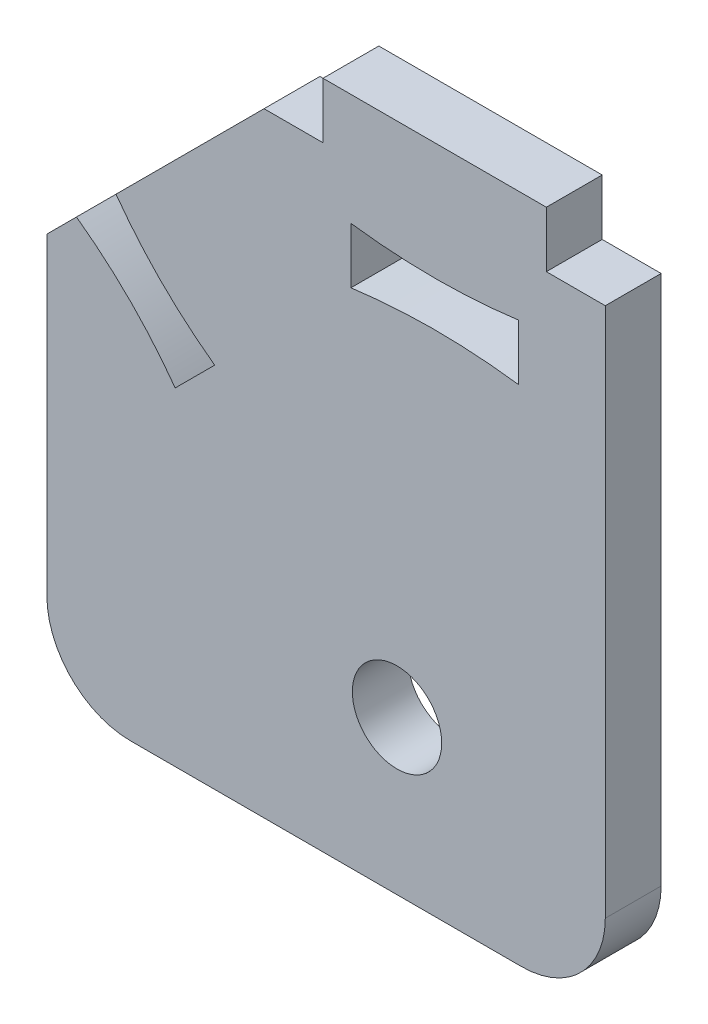
ISO-10303-21;
HEADER;
FILE_DESCRIPTION(('STEP AP214'),'2;1');
FILE_NAME('part.step','',(''),(''),'','','');
FILE_SCHEMA(('AUTOMOTIVE_DESIGN { 1 0 10303 214 1 1 1 1 }'));
ENDSEC;
DATA;
#1=APPLICATION_CONTEXT('core data for automotive mechanical design processes');
#2=APPLICATION_PROTOCOL_DEFINITION('international standard','automotive_design',2000,#1);
#3=PRODUCT_CONTEXT('',#1,'mechanical');
#4=PRODUCT('Part','Part','',(#3));
#5=PRODUCT_RELATED_PRODUCT_CATEGORY('part','',(#4));
#6=PRODUCT_DEFINITION_FORMATION('','',#4);
#7=PRODUCT_DEFINITION_CONTEXT('part definition',#1,'design');
#8=PRODUCT_DEFINITION('design','',#6,#7);
#9=PRODUCT_DEFINITION_SHAPE('','',#8);
#10=(LENGTH_UNIT() NAMED_UNIT(*) SI_UNIT(.MILLI.,.METRE.));
#11=(NAMED_UNIT(*) PLANE_ANGLE_UNIT() SI_UNIT($,.RADIAN.));
#12=(NAMED_UNIT(*) SI_UNIT($,.STERADIAN.) SOLID_ANGLE_UNIT());
#13=UNCERTAINTY_MEASURE_WITH_UNIT(LENGTH_MEASURE(1.E-05),#10,'distance_accuracy_value','');
#14=(GEOMETRIC_REPRESENTATION_CONTEXT(3) GLOBAL_UNCERTAINTY_ASSIGNED_CONTEXT((#13)) GLOBAL_UNIT_ASSIGNED_CONTEXT((#10,
#11,#12)) REPRESENTATION_CONTEXT('',''));
#15=CARTESIAN_POINT('',(0.,0.,0.));
#16=DIRECTION('',(0.,0.,1.));
#17=DIRECTION('',(1.,0.,0.));
#18=AXIS2_PLACEMENT_3D('',#15,#16,#17);
#19=CARTESIAN_POINT('',(4.10121933088198,14.7875108318972,2.));
#20=DIRECTION('',(0.,0.,-1.));
#21=DIRECTION('',(-1.,0.,0.));
#22=AXIS2_PLACEMENT_3D('',#19,#20,#21);
#23=PLANE('',#22);
#24=CARTESIAN_POINT('',(10.889087296526,18.,2.));
#25=CARTESIAN_POINT('',(13.889087296526,18.4,2.));
#26=CARTESIAN_POINT('',(16.889087296526,18.,2.));
#27=B_SPLINE_CURVE_WITH_KNOTS('',2,(#24,#25,#26),.UNSPECIFIED.,.F.,.F.,(3,3),(0.,1.),.UNSPECIFIED.);
#28=CARTESIAN_POINT('',(10.889087296526,18.,2.));
#29=VERTEX_POINT('',#28);
#30=CARTESIAN_POINT('',(16.889087296526,18.,2.));
#31=VERTEX_POINT('',#30);
#32=EDGE_CURVE('E166',#29,#31,#27,.T.);
#33=ORIENTED_EDGE('',*,*,#32,.F.);
#34=DIRECTION('',(0.,-1.,0.));
#35=VECTOR('',#34,1.);
#36=CARTESIAN_POINT('',(10.889087296526,20.,2.));
#37=LINE('',#36,#35);
#38=CARTESIAN_POINT('',(10.889087296526,20.,2.));
#39=VERTEX_POINT('',#38);
#40=EDGE_CURVE('E192',#39,#29,#37,.T.);
#41=ORIENTED_EDGE('',*,*,#40,.F.);
#42=CARTESIAN_POINT('',(16.889087296526,20.,2.));
#43=CARTESIAN_POINT('',(13.889087296526,19.6,2.));
#44=CARTESIAN_POINT('',(10.889087296526,20.,2.));
#45=B_SPLINE_CURVE_WITH_KNOTS('',2,(#42,#43,#44),.UNSPECIFIED.,.F.,.F.,(3,3),(0.,1.),.UNSPECIFIED.);
#46=CARTESIAN_POINT('',(16.889087296526,20.,2.));
#47=VERTEX_POINT('',#46);
#48=EDGE_CURVE('E190',#47,#39,#45,.T.);
#49=ORIENTED_EDGE('',*,*,#48,.F.);
#50=DIRECTION('',(0.,1.,0.));
#51=VECTOR('',#50,1.);
#52=CARTESIAN_POINT('',(16.889087296526,20.,2.));
#53=LINE('',#52,#51);
#54=EDGE_CURVE('E176',#31,#47,#53,.T.);
#55=ORIENTED_EDGE('',*,*,#54,.F.);
#56=EDGE_LOOP('',(#33,#41,#49,#55));
#57=FACE_BOUND('',#56,.T.);
#58=DIRECTION('',(1.,0.,0.));
#59=VECTOR('',#58,1.);
#60=CARTESIAN_POINT('',(0.,0.,2.));
#61=LINE('',#60,#59);
#62=CARTESIAN_POINT('',(3.,0.,2.));
#63=VERTEX_POINT('',#62);
#64=CARTESIAN_POINT('',(17.,0.,2.));
#65=VERTEX_POINT('',#64);
#66=EDGE_CURVE('E290',#63,#65,#61,.T.);
#67=ORIENTED_EDGE('',*,*,#66,.T.);
#68=CARTESIAN_POINT('',(17.,3.,2.));
#69=DIRECTION('',(0.,0.,-1.));
#70=DIRECTION('',(-1.,0.,0.));
#71=AXIS2_PLACEMENT_3D('',#68,#69,#70);
#72=CIRCLE('',#71,3.);
#73=CARTESIAN_POINT('',(20.,3.,2.));
#74=VERTEX_POINT('',#73);
#75=EDGE_CURVE('E40',#65,#74,#72,.F.);
#76=ORIENTED_EDGE('',*,*,#75,.T.);
#77=DIRECTION('',(0.,1.,0.));
#78=VECTOR('',#77,1.);
#79=CARTESIAN_POINT('',(20.,0.,2.));
#80=LINE('',#79,#78);
#81=CARTESIAN_POINT('',(20.,22.,2.));
#82=VERTEX_POINT('',#81);
#83=EDGE_CURVE('E338',#74,#82,#80,.T.);
#84=ORIENTED_EDGE('',*,*,#83,.T.);
#85=DIRECTION('',(-1.,0.,0.));
#86=VECTOR('',#85,1.);
#87=CARTESIAN_POINT('',(20.,22.,2.));
#88=LINE('',#87,#86);
#89=CARTESIAN_POINT('',(17.889087296526,22.,2.));
#90=VERTEX_POINT('',#89);
#91=EDGE_CURVE('E346',#82,#90,#88,.T.);
#92=ORIENTED_EDGE('',*,*,#91,.T.);
#93=DIRECTION('',(0.,1.,0.));
#94=VECTOR('',#93,1.);
#95=CARTESIAN_POINT('',(17.889087296526,24.,2.));
#96=LINE('',#95,#94);
#97=CARTESIAN_POINT('',(17.889087296526,24.,2.));
#98=VERTEX_POINT('',#97);
#99=EDGE_CURVE('E402',#90,#98,#96,.T.);
#100=ORIENTED_EDGE('',*,*,#99,.T.);
#101=DIRECTION('',(-1.,0.,0.));
#102=VECTOR('',#101,1.);
#103=CARTESIAN_POINT('',(9.88908729652604,24.,2.));
#104=LINE('',#103,#102);
#105=CARTESIAN_POINT('',(9.88908729652604,24.,2.));
#106=VERTEX_POINT('',#105);
#107=EDGE_CURVE('E398',#98,#106,#104,.T.);
#108=ORIENTED_EDGE('',*,*,#107,.T.);
#109=DIRECTION('',(0.,-1.,0.));
#110=VECTOR('',#109,1.);
#111=CARTESIAN_POINT('',(9.88908729652604,22.,2.));
#112=LINE('',#111,#110);
#113=CARTESIAN_POINT('',(9.88908729652604,22.,2.));
#114=VERTEX_POINT('',#113);
#115=EDGE_CURVE('E390',#106,#114,#112,.T.);
#116=ORIENTED_EDGE('',*,*,#115,.T.);
#117=DIRECTION('',(-1.,0.,0.));
#118=VECTOR('',#117,1.);
#119=CARTESIAN_POINT('',(9.88908729652604,22.,2.));
#120=LINE('',#119,#118);
#121=CARTESIAN_POINT('',(7.77817459305208,22.,2.));
#122=VERTEX_POINT('',#121);
#123=EDGE_CURVE('E385',#114,#122,#120,.T.);
#124=ORIENTED_EDGE('',*,*,#123,.T.);
#125=DIRECTION('',(-0.707106781186553,-0.707106781186542,0.));
#126=VECTOR('',#125,1.);
#127=CARTESIAN_POINT('',(2.47487373415294,16.6966991411009,2.));
#128=LINE('',#127,#126);
#129=CARTESIAN_POINT('',(2.47487373415294,16.6966991411009,2.));
#130=VERTEX_POINT('',#129);
#131=EDGE_CURVE('E381',#122,#130,#128,.T.);
#132=ORIENTED_EDGE('',*,*,#131,.T.);
#133=CARTESIAN_POINT('',(2.47487373415294,16.6966991411009,2.));
#134=CARTESIAN_POINT('',(3.95979797464467,14.6460894756599,2.));
#135=CARTESIAN_POINT('',(6.01040764008564,13.1611652351682,2.));
#136=B_SPLINE_CURVE_WITH_KNOTS('',2,(#133,#134,#135),.UNSPECIFIED.,.F.,.F.,(3,3),(0.,1.),.UNSPECIFIED.);
#137=CARTESIAN_POINT('',(6.01040764008565,13.1611652351682,2.));
#138=VERTEX_POINT('',#137);
#139=EDGE_CURVE('E372',#130,#138,#136,.T.);
#140=ORIENTED_EDGE('',*,*,#139,.T.);
#141=DIRECTION('',(-0.707106781186553,-0.707106781186542,0.));
#142=VECTOR('',#141,1.);
#143=CARTESIAN_POINT('',(4.59619407771254,11.7469516727951,2.));
#144=LINE('',#143,#142);
#145=CARTESIAN_POINT('',(4.59619407771254,11.7469516727951,2.));
#146=VERTEX_POINT('',#145);
#147=EDGE_CURVE('E246',#138,#146,#144,.T.);
#148=ORIENTED_EDGE('',*,*,#147,.T.);
#149=CARTESIAN_POINT('',(4.59619407771254,11.7469516727951,2.));
#150=CARTESIAN_POINT('',(3.1112698372208,13.7975613382361,2.));
#151=CARTESIAN_POINT('',(1.06066017177983,15.2824855787278,2.));
#152=B_SPLINE_CURVE_WITH_KNOTS('',2,(#149,#150,#151),.UNSPECIFIED.,.F.,.F.,(3,3),(0.,1.),.UNSPECIFIED.);
#153=CARTESIAN_POINT('',(1.06066017177983,15.2824855787278,2.));
#154=VERTEX_POINT('',#153);
#155=EDGE_CURVE('E239',#146,#154,#152,.T.);
#156=ORIENTED_EDGE('',*,*,#155,.T.);
#157=DIRECTION('',(-0.707106781186554,-0.707106781186541,0.));
#158=VECTOR('',#157,1.);
#159=CARTESIAN_POINT('',(0.,14.221825406948,2.));
#160=LINE('',#159,#158);
#161=CARTESIAN_POINT('',(0.,14.221825406948,2.));
#162=VERTEX_POINT('',#161);
#163=EDGE_CURVE('E245',#154,#162,#160,.T.);
#164=ORIENTED_EDGE('',*,*,#163,.T.);
#165=DIRECTION('',(0.,-1.,0.));
#166=VECTOR('',#165,1.);
#167=CARTESIAN_POINT('',(0.,0.,2.));
#168=LINE('',#167,#166);
#169=CARTESIAN_POINT('',(0.,3.,2.));
#170=VERTEX_POINT('',#169);
#171=EDGE_CURVE('E252',#162,#170,#168,.T.);
#172=ORIENTED_EDGE('',*,*,#171,.T.);
#173=CARTESIAN_POINT('',(3.,3.,2.));
#174=DIRECTION('',(0.,0.,-1.));
#175=DIRECTION('',(-1.,0.,0.));
#176=AXIS2_PLACEMENT_3D('',#173,#174,#175);
#177=CIRCLE('',#176,3.);
#178=EDGE_CURVE('E334',#170,#63,#177,.F.);
#179=ORIENTED_EDGE('',*,*,#178,.T.);
#180=EDGE_LOOP('',(#67,#76,#84,#92,#100,#108,#116,#124,#132,#140,#148,#156,#164,#172,#179));
#181=FACE_BOUND('',#180,.T.);
#182=CARTESIAN_POINT('',(12.5402020253552,5.5,2.));
#183=DIRECTION('',(0.,0.,1.));
#184=DIRECTION('',(1.,0.,0.));
#185=AXIS2_PLACEMENT_3D('',#182,#183,#184);
#186=CIRCLE('',#185,1.6);
#187=CARTESIAN_POINT('',(14.1402020253552,5.5,2.));
#188=VERTEX_POINT('',#187);
#189=EDGE_CURVE('E450',#188,#188,#186,.T.);
#190=ORIENTED_EDGE('',*,*,#189,.F.);
#191=EDGE_LOOP('',(#190));
#192=FACE_BOUND('',#191,.T.);
#193=ADVANCED_FACE('F32',(#57,#181,#192),#23,.F.);
#194=CARTESIAN_POINT('',(4.10121933088198,14.7875108318972,0.));
#195=DIRECTION('',(0.,0.,-1.));
#196=DIRECTION('',(-1.,0.,0.));
#197=AXIS2_PLACEMENT_3D('',#194,#195,#196);
#198=PLANE('',#197);
#199=DIRECTION('',(0.,-1.,0.));
#200=VECTOR('',#199,1.);
#201=CARTESIAN_POINT('',(10.889087296526,20.,0.));
#202=LINE('',#201,#200);
#203=CARTESIAN_POINT('',(10.889087296526,20.,0.));
#204=VERTEX_POINT('',#203);
#205=CARTESIAN_POINT('',(10.889087296526,18.,0.));
#206=VERTEX_POINT('',#205);
#207=EDGE_CURVE('E177',#204,#206,#202,.T.);
#208=ORIENTED_EDGE('',*,*,#207,.T.);
#209=CARTESIAN_POINT('',(10.889087296526,18.,0.));
#210=CARTESIAN_POINT('',(13.889087296526,18.4,0.));
#211=CARTESIAN_POINT('',(16.889087296526,18.,0.));
#212=B_SPLINE_CURVE_WITH_KNOTS('',2,(#209,#210,#211),.UNSPECIFIED.,.F.,.F.,(3,3),(0.,1.),.UNSPECIFIED.);
#213=CARTESIAN_POINT('',(16.889087296526,18.,0.));
#214=VERTEX_POINT('',#213);
#215=EDGE_CURVE('E454',#206,#214,#212,.T.);
#216=ORIENTED_EDGE('',*,*,#215,.T.);
#217=DIRECTION('',(0.,1.,0.));
#218=VECTOR('',#217,1.);
#219=CARTESIAN_POINT('',(16.889087296526,20.,0.));
#220=LINE('',#219,#218);
#221=CARTESIAN_POINT('',(16.889087296526,20.,0.));
#222=VERTEX_POINT('',#221);
#223=EDGE_CURVE('E183',#214,#222,#220,.T.);
#224=ORIENTED_EDGE('',*,*,#223,.T.);
#225=CARTESIAN_POINT('',(16.889087296526,20.,0.));
#226=CARTESIAN_POINT('',(13.889087296526,19.6,0.));
#227=CARTESIAN_POINT('',(10.889087296526,20.,0.));
#228=B_SPLINE_CURVE_WITH_KNOTS('',2,(#225,#226,#227),.UNSPECIFIED.,.F.,.F.,(3,3),(0.,1.),.UNSPECIFIED.);
#229=EDGE_CURVE('E457',#222,#204,#228,.T.);
#230=ORIENTED_EDGE('',*,*,#229,.T.);
#231=EDGE_LOOP('',(#208,#216,#224,#230));
#232=FACE_BOUND('',#231,.T.);
#233=DIRECTION('',(0.,1.,0.));
#234=VECTOR('',#233,1.);
#235=CARTESIAN_POINT('',(20.,0.,0.));
#236=LINE('',#235,#234);
#237=CARTESIAN_POINT('',(20.,3.,0.));
#238=VERTEX_POINT('',#237);
#239=CARTESIAN_POINT('',(20.,22.,0.));
#240=VERTEX_POINT('',#239);
#241=EDGE_CURVE('E256',#238,#240,#236,.T.);
#242=ORIENTED_EDGE('',*,*,#241,.F.);
#243=CARTESIAN_POINT('',(17.,3.,0.));
#244=DIRECTION('',(0.,0.,-1.));
#245=DIRECTION('',(-1.,0.,0.));
#246=AXIS2_PLACEMENT_3D('',#243,#244,#245);
#247=CIRCLE('',#246,3.);
#248=CARTESIAN_POINT('',(17.,0.,0.));
#249=VERTEX_POINT('',#248);
#250=EDGE_CURVE('E328',#238,#249,#247,.T.);
#251=ORIENTED_EDGE('',*,*,#250,.T.);
#252=DIRECTION('',(1.,0.,0.));
#253=VECTOR('',#252,1.);
#254=CARTESIAN_POINT('',(0.,0.,0.));
#255=LINE('',#254,#253);
#256=CARTESIAN_POINT('',(3.,0.,0.));
#257=VERTEX_POINT('',#256);
#258=EDGE_CURVE('E184',#257,#249,#255,.T.);
#259=ORIENTED_EDGE('',*,*,#258,.F.);
#260=CARTESIAN_POINT('',(3.,3.,0.));
#261=DIRECTION('',(0.,0.,-1.));
#262=DIRECTION('',(-1.,0.,0.));
#263=AXIS2_PLACEMENT_3D('',#260,#261,#262);
#264=CIRCLE('',#263,3.);
#265=CARTESIAN_POINT('',(0.,3.,0.));
#266=VERTEX_POINT('',#265);
#267=EDGE_CURVE('E326',#257,#266,#264,.T.);
#268=ORIENTED_EDGE('',*,*,#267,.T.);
#269=DIRECTION('',(0.,-1.,0.));
#270=VECTOR('',#269,1.);
#271=CARTESIAN_POINT('',(0.,0.,0.));
#272=LINE('',#271,#270);
#273=CARTESIAN_POINT('',(0.,14.221825406948,0.));
#274=VERTEX_POINT('',#273);
#275=EDGE_CURVE('E288',#274,#266,#272,.T.);
#276=ORIENTED_EDGE('',*,*,#275,.F.);
#277=DIRECTION('',(-0.707106781186554,-0.707106781186541,0.));
#278=VECTOR('',#277,1.);
#279=CARTESIAN_POINT('',(0.,14.221825406948,0.));
#280=LINE('',#279,#278);
#281=CARTESIAN_POINT('',(1.06066017177983,15.2824855787278,0.));
#282=VERTEX_POINT('',#281);
#283=EDGE_CURVE('E283',#282,#274,#280,.T.);
#284=ORIENTED_EDGE('',*,*,#283,.F.);
#285=CARTESIAN_POINT('',(4.59619407771254,11.7469516727951,0.));
#286=CARTESIAN_POINT('',(3.1112698372208,13.7975613382361,0.));
#287=CARTESIAN_POINT('',(1.06066017177983,15.2824855787278,0.));
#288=B_SPLINE_CURVE_WITH_KNOTS('',2,(#285,#286,#287),.UNSPECIFIED.,.F.,.F.,(3,3),(0.,1.),.UNSPECIFIED.);
#289=CARTESIAN_POINT('',(4.59619407771254,11.7469516727951,0.));
#290=VERTEX_POINT('',#289);
#291=EDGE_CURVE('E279',#290,#282,#288,.T.);
#292=ORIENTED_EDGE('',*,*,#291,.F.);
#293=DIRECTION('',(-0.707106781186553,-0.707106781186542,0.));
#294=VECTOR('',#293,1.);
#295=CARTESIAN_POINT('',(4.59619407771254,11.7469516727951,0.));
#296=LINE('',#295,#294);
#297=CARTESIAN_POINT('',(6.01040764008565,13.1611652351682,0.));
#298=VERTEX_POINT('',#297);
#299=EDGE_CURVE('E274',#298,#290,#296,.T.);
#300=ORIENTED_EDGE('',*,*,#299,.F.);
#301=CARTESIAN_POINT('',(2.47487373415294,16.6966991411009,0.));
#302=CARTESIAN_POINT('',(3.95979797464467,14.6460894756599,0.));
#303=CARTESIAN_POINT('',(6.01040764008564,13.1611652351682,0.));
#304=B_SPLINE_CURVE_WITH_KNOTS('',2,(#301,#302,#303),.UNSPECIFIED.,.F.,.F.,(3,3),(0.,1.),.UNSPECIFIED.);
#305=CARTESIAN_POINT('',(2.47487373415294,16.6966991411009,0.));
#306=VERTEX_POINT('',#305);
#307=EDGE_CURVE('E270',#306,#298,#304,.T.);
#308=ORIENTED_EDGE('',*,*,#307,.F.);
#309=DIRECTION('',(-0.707106781186553,-0.707106781186542,0.));
#310=VECTOR('',#309,1.);
#311=CARTESIAN_POINT('',(2.47487373415294,16.6966991411009,0.));
#312=LINE('',#311,#310);
#313=CARTESIAN_POINT('',(7.77817459305208,22.,0.));
#314=VERTEX_POINT('',#313);
#315=EDGE_CURVE('E268',#314,#306,#312,.T.);
#316=ORIENTED_EDGE('',*,*,#315,.F.);
#317=DIRECTION('',(-1.,0.,0.));
#318=VECTOR('',#317,1.);
#319=CARTESIAN_POINT('',(9.88908729652604,22.,0.));
#320=LINE('',#319,#318);
#321=CARTESIAN_POINT('',(9.88908729652604,22.,0.));
#322=VERTEX_POINT('',#321);
#323=EDGE_CURVE('E266',#322,#314,#320,.T.);
#324=ORIENTED_EDGE('',*,*,#323,.F.);
#325=DIRECTION('',(0.,-1.,0.));
#326=VECTOR('',#325,1.);
#327=CARTESIAN_POINT('',(9.88908729652604,22.,0.));
#328=LINE('',#327,#326);
#329=CARTESIAN_POINT('',(9.88908729652604,24.,0.));
#330=VERTEX_POINT('',#329);
#331=EDGE_CURVE('E264',#330,#322,#328,.T.);
#332=ORIENTED_EDGE('',*,*,#331,.F.);
#333=DIRECTION('',(-1.,0.,0.));
#334=VECTOR('',#333,1.);
#335=CARTESIAN_POINT('',(9.88908729652604,24.,0.));
#336=LINE('',#335,#334);
#337=CARTESIAN_POINT('',(17.889087296526,24.,0.));
#338=VERTEX_POINT('',#337);
#339=EDGE_CURVE('E262',#338,#330,#336,.T.);
#340=ORIENTED_EDGE('',*,*,#339,.F.);
#341=DIRECTION('',(0.,1.,0.));
#342=VECTOR('',#341,1.);
#343=CARTESIAN_POINT('',(17.889087296526,24.,0.));
#344=LINE('',#343,#342);
#345=CARTESIAN_POINT('',(17.889087296526,22.,0.));
#346=VERTEX_POINT('',#345);
#347=EDGE_CURVE('E260',#346,#338,#344,.T.);
#348=ORIENTED_EDGE('',*,*,#347,.F.);
#349=DIRECTION('',(-1.,0.,0.));
#350=VECTOR('',#349,1.);
#351=CARTESIAN_POINT('',(20.,22.,0.));
#352=LINE('',#351,#350);
#353=EDGE_CURVE('E258',#240,#346,#352,.T.);
#354=ORIENTED_EDGE('',*,*,#353,.F.);
#355=EDGE_LOOP('',(#242,#251,#259,#268,#276,#284,#292,#300,#308,#316,#324,#332,#340,#348,#354));
#356=FACE_BOUND('',#355,.T.);
#357=CARTESIAN_POINT('',(12.5402020253552,5.5,0.));
#358=DIRECTION('',(0.,0.,1.));
#359=DIRECTION('',(1.,0.,0.));
#360=AXIS2_PLACEMENT_3D('',#357,#358,#359);
#361=CIRCLE('',#360,1.6);
#362=CARTESIAN_POINT('',(14.1402020253552,5.5,0.));
#363=VERTEX_POINT('',#362);
#364=EDGE_CURVE('E453',#363,#363,#361,.T.);
#365=ORIENTED_EDGE('',*,*,#364,.T.);
#366=EDGE_LOOP('',(#365));
#367=FACE_BOUND('',#366,.T.);
#368=ADVANCED_FACE('F221',(#232,#356,#367),#198,.T.);
#369=CARTESIAN_POINT('',(0.,0.,2.));
#370=DIRECTION('',(0.,1.,0.));
#371=DIRECTION('',(0.,0.,1.));
#372=AXIS2_PLACEMENT_3D('',#369,#370,#371);
#373=PLANE('',#372);
#374=ORIENTED_EDGE('',*,*,#258,.T.);
#375=DIRECTION('',(0.,0.,-1.));
#376=VECTOR('',#375,1.);
#377=CARTESIAN_POINT('',(17.,0.,2.));
#378=LINE('',#377,#376);
#379=EDGE_CURVE('E53',#249,#65,#378,.F.);
#380=ORIENTED_EDGE('',*,*,#379,.T.);
#381=ORIENTED_EDGE('',*,*,#66,.F.);
#382=DIRECTION('',(0.,0.,-1.));
#383=VECTOR('',#382,1.);
#384=CARTESIAN_POINT('',(3.,0.,2.));
#385=LINE('',#384,#383);
#386=EDGE_CURVE('E330',#63,#257,#385,.T.);
#387=ORIENTED_EDGE('',*,*,#386,.T.);
#388=EDGE_LOOP('',(#374,#380,#381,#387));
#389=FACE_BOUND('',#388,.T.);
#390=ADVANCED_FACE('F224',(#389),#373,.F.);
#391=CARTESIAN_POINT('',(20.,0.,2.));
#392=DIRECTION('',(-1.,0.,0.));
#393=DIRECTION('',(0.,0.,1.));
#394=AXIS2_PLACEMENT_3D('',#391,#392,#393);
#395=PLANE('',#394);
#396=ORIENTED_EDGE('',*,*,#83,.F.);
#397=DIRECTION('',(0.,0.,-1.));
#398=VECTOR('',#397,1.);
#399=CARTESIAN_POINT('',(20.,3.,2.));
#400=LINE('',#399,#398);
#401=EDGE_CURVE('E323',#74,#238,#400,.T.);
#402=ORIENTED_EDGE('',*,*,#401,.T.);
#403=ORIENTED_EDGE('',*,*,#241,.T.);
#404=DIRECTION('',(0.,0.,-1.));
#405=VECTOR('',#404,1.);
#406=CARTESIAN_POINT('',(20.,22.,2.));
#407=LINE('',#406,#405);
#408=EDGE_CURVE('E320',#82,#240,#407,.T.);
#409=ORIENTED_EDGE('',*,*,#408,.F.);
#410=EDGE_LOOP('',(#396,#402,#403,#409));
#411=FACE_BOUND('',#410,.T.);
#412=ADVANCED_FACE('F343',(#411),#395,.F.);
#413=CARTESIAN_POINT('',(20.,22.,2.));
#414=DIRECTION('',(0.,-1.,0.));
#415=DIRECTION('',(1.,0.,0.));
#416=AXIS2_PLACEMENT_3D('',#413,#414,#415);
#417=PLANE('',#416);
#418=ORIENTED_EDGE('',*,*,#353,.T.);
#419=DIRECTION('',(0.,0.,-1.));
#420=VECTOR('',#419,1.);
#421=CARTESIAN_POINT('',(17.889087296526,22.,2.));
#422=LINE('',#421,#420);
#423=EDGE_CURVE('E317',#90,#346,#422,.T.);
#424=ORIENTED_EDGE('',*,*,#423,.F.);
#425=ORIENTED_EDGE('',*,*,#91,.F.);
#426=ORIENTED_EDGE('',*,*,#408,.T.);
#427=EDGE_LOOP('',(#418,#424,#425,#426));
#428=FACE_BOUND('',#427,.T.);
#429=ADVANCED_FACE('F405',(#428),#417,.F.);
#430=CARTESIAN_POINT('',(17.889087296526,24.,2.));
#431=DIRECTION('',(-1.,0.,0.));
#432=DIRECTION('',(0.,0.,1.));
#433=AXIS2_PLACEMENT_3D('',#430,#431,#432);
#434=PLANE('',#433);
#435=ORIENTED_EDGE('',*,*,#347,.T.);
#436=DIRECTION('',(0.,0.,-1.));
#437=VECTOR('',#436,1.);
#438=CARTESIAN_POINT('',(17.889087296526,24.,2.));
#439=LINE('',#438,#437);
#440=EDGE_CURVE('E314',#98,#338,#439,.T.);
#441=ORIENTED_EDGE('',*,*,#440,.F.);
#442=ORIENTED_EDGE('',*,*,#99,.F.);
#443=ORIENTED_EDGE('',*,*,#423,.T.);
#444=EDGE_LOOP('',(#435,#441,#442,#443));
#445=FACE_BOUND('',#444,.T.);
#446=ADVANCED_FACE('F401',(#445),#434,.F.);
#447=CARTESIAN_POINT('',(9.88908729652604,24.,2.));
#448=DIRECTION('',(0.,-1.,0.));
#449=DIRECTION('',(0.,0.,-1.));
#450=AXIS2_PLACEMENT_3D('',#447,#448,#449);
#451=PLANE('',#450);
#452=ORIENTED_EDGE('',*,*,#339,.T.);
#453=DIRECTION('',(0.,0.,-1.));
#454=VECTOR('',#453,1.);
#455=CARTESIAN_POINT('',(9.88908729652604,24.,2.));
#456=LINE('',#455,#454);
#457=EDGE_CURVE('E311',#106,#330,#456,.T.);
#458=ORIENTED_EDGE('',*,*,#457,.F.);
#459=ORIENTED_EDGE('',*,*,#107,.F.);
#460=ORIENTED_EDGE('',*,*,#440,.T.);
#461=EDGE_LOOP('',(#452,#458,#459,#460));
#462=FACE_BOUND('',#461,.T.);
#463=ADVANCED_FACE('F395',(#462),#451,.F.);
#464=CARTESIAN_POINT('',(9.88908729652604,22.,2.));
#465=DIRECTION('',(1.,0.,0.));
#466=DIRECTION('',(0.,1.,0.));
#467=AXIS2_PLACEMENT_3D('',#464,#465,#466);
#468=PLANE('',#467);
#469=ORIENTED_EDGE('',*,*,#331,.T.);
#470=DIRECTION('',(0.,0.,-1.));
#471=VECTOR('',#470,1.);
#472=CARTESIAN_POINT('',(9.88908729652604,22.,2.));
#473=LINE('',#472,#471);
#474=EDGE_CURVE('E308',#114,#322,#473,.T.);
#475=ORIENTED_EDGE('',*,*,#474,.F.);
#476=ORIENTED_EDGE('',*,*,#115,.F.);
#477=ORIENTED_EDGE('',*,*,#457,.T.);
#478=EDGE_LOOP('',(#469,#475,#476,#477));
#479=FACE_BOUND('',#478,.T.);
#480=ADVANCED_FACE('F389',(#479),#468,.F.);
#481=CARTESIAN_POINT('',(9.88908729652604,22.,2.));
#482=DIRECTION('',(0.,-1.,0.));
#483=DIRECTION('',(1.,0.,0.));
#484=AXIS2_PLACEMENT_3D('',#481,#482,#483);
#485=PLANE('',#484);
#486=ORIENTED_EDGE('',*,*,#323,.T.);
#487=DIRECTION('',(0.,0.,-1.));
#488=VECTOR('',#487,1.);
#489=CARTESIAN_POINT('',(7.77817459305208,22.,2.));
#490=LINE('',#489,#488);
#491=EDGE_CURVE('E305',#122,#314,#490,.T.);
#492=ORIENTED_EDGE('',*,*,#491,.F.);
#493=ORIENTED_EDGE('',*,*,#123,.F.);
#494=ORIENTED_EDGE('',*,*,#474,.T.);
#495=EDGE_LOOP('',(#486,#492,#493,#494));
#496=FACE_BOUND('',#495,.T.);
#497=ADVANCED_FACE('F384',(#496),#485,.F.);
#498=CARTESIAN_POINT('',(2.47487373415294,16.6966991411009,2.));
#499=DIRECTION('',(0.707106781186542,-0.707106781186553,0.));
#500=DIRECTION('',(0.707106781186553,0.707106781186542,0.));
#501=AXIS2_PLACEMENT_3D('',#498,#499,#500);
#502=PLANE('',#501);
#503=ORIENTED_EDGE('',*,*,#315,.T.);
#504=DIRECTION('',(0.,0.,-1.));
#505=VECTOR('',#504,1.);
#506=CARTESIAN_POINT('',(2.47487373415294,16.6966991411009,2.));
#507=LINE('',#506,#505);
#508=EDGE_CURVE('E302',#130,#306,#507,.T.);
#509=ORIENTED_EDGE('',*,*,#508,.F.);
#510=ORIENTED_EDGE('',*,*,#131,.F.);
#511=ORIENTED_EDGE('',*,*,#491,.T.);
#512=EDGE_LOOP('',(#503,#509,#510,#511));
#513=FACE_BOUND('',#512,.T.);
#514=ADVANCED_FACE('F378',(#513),#502,.F.);
#515=DIRECTION('',(0.,0.,-1.));
#516=VECTOR('',#515,1.);
#517=SURFACE_OF_LINEAR_EXTRUSION('',#136,#516);
#518=ORIENTED_EDGE('',*,*,#307,.T.);
#519=DIRECTION('',(0.,0.,-1.));
#520=VECTOR('',#519,1.);
#521=CARTESIAN_POINT('',(6.01040764008565,13.1611652351682,2.));
#522=LINE('',#521,#520);
#523=EDGE_CURVE('E299',#138,#298,#522,.T.);
#524=ORIENTED_EDGE('',*,*,#523,.F.);
#525=ORIENTED_EDGE('',*,*,#139,.F.);
#526=ORIENTED_EDGE('',*,*,#508,.T.);
#527=EDGE_LOOP('',(#518,#524,#525,#526));
#528=FACE_BOUND('',#527,.T.);
#529=ADVANCED_FACE('F371',(#528),#517,.F.);
#530=CARTESIAN_POINT('',(4.59619407771254,11.7469516727951,2.));
#531=DIRECTION('',(0.707106781186542,-0.707106781186553,0.));
#532=DIRECTION('',(0.707106781186553,0.707106781186542,0.));
#533=AXIS2_PLACEMENT_3D('',#530,#531,#532);
#534=PLANE('',#533);
#535=ORIENTED_EDGE('',*,*,#299,.T.);
#536=DIRECTION('',(0.,0.,-1.));
#537=VECTOR('',#536,1.);
#538=CARTESIAN_POINT('',(4.59619407771254,11.7469516727951,2.));
#539=LINE('',#538,#537);
#540=EDGE_CURVE('E296',#146,#290,#539,.T.);
#541=ORIENTED_EDGE('',*,*,#540,.F.);
#542=ORIENTED_EDGE('',*,*,#147,.F.);
#543=ORIENTED_EDGE('',*,*,#523,.T.);
#544=EDGE_LOOP('',(#535,#541,#542,#543));
#545=FACE_BOUND('',#544,.T.);
#546=ADVANCED_FACE('F236',(#545),#534,.F.);
#547=DIRECTION('',(0.,0.,-1.));
#548=VECTOR('',#547,1.);
#549=SURFACE_OF_LINEAR_EXTRUSION('',#152,#548);
#550=ORIENTED_EDGE('',*,*,#291,.T.);
#551=DIRECTION('',(0.,0.,-1.));
#552=VECTOR('',#551,1.);
#553=CARTESIAN_POINT('',(1.06066017177983,15.2824855787278,2.));
#554=LINE('',#553,#552);
#555=EDGE_CURVE('E293',#154,#282,#554,.T.);
#556=ORIENTED_EDGE('',*,*,#555,.F.);
#557=ORIENTED_EDGE('',*,*,#155,.F.);
#558=ORIENTED_EDGE('',*,*,#540,.T.);
#559=EDGE_LOOP('',(#550,#556,#557,#558));
#560=FACE_BOUND('',#559,.T.);
#561=ADVANCED_FACE('F231',(#560),#549,.F.);
#562=CARTESIAN_POINT('',(0.,14.221825406948,2.));
#563=DIRECTION('',(0.707106781186541,-0.707106781186554,0.));
#564=DIRECTION('',(0.707106781186554,0.707106781186541,0.));
#565=AXIS2_PLACEMENT_3D('',#562,#563,#564);
#566=PLANE('',#565);
#567=ORIENTED_EDGE('',*,*,#283,.T.);
#568=DIRECTION('',(0.,0.,-1.));
#569=VECTOR('',#568,1.);
#570=CARTESIAN_POINT('',(0.,14.221825406948,2.));
#571=LINE('',#570,#569);
#572=EDGE_CURVE('E254',#162,#274,#571,.T.);
#573=ORIENTED_EDGE('',*,*,#572,.F.);
#574=ORIENTED_EDGE('',*,*,#163,.F.);
#575=ORIENTED_EDGE('',*,*,#555,.T.);
#576=EDGE_LOOP('',(#567,#573,#574,#575));
#577=FACE_BOUND('',#576,.T.);
#578=ADVANCED_FACE('F228',(#577),#566,.F.);
#579=CARTESIAN_POINT('',(0.,0.,2.));
#580=DIRECTION('',(1.,0.,0.));
#581=DIRECTION('',(0.,1.,0.));
#582=AXIS2_PLACEMENT_3D('',#579,#580,#581);
#583=PLANE('',#582);
#584=ORIENTED_EDGE('',*,*,#275,.T.);
#585=DIRECTION('',(0.,0.,-1.));
#586=VECTOR('',#585,1.);
#587=CARTESIAN_POINT('',(0.,3.,2.));
#588=LINE('',#587,#586);
#589=EDGE_CURVE('E11',#266,#170,#588,.F.);
#590=ORIENTED_EDGE('',*,*,#589,.T.);
#591=ORIENTED_EDGE('',*,*,#171,.F.);
#592=ORIENTED_EDGE('',*,*,#572,.T.);
#593=EDGE_LOOP('',(#584,#590,#591,#592));
#594=FACE_BOUND('',#593,.T.);
#595=ADVANCED_FACE('F218',(#594),#583,.F.);
#596=DIRECTION('',(0.,0.,-1.));
#597=VECTOR('',#596,1.);
#598=SURFACE_OF_LINEAR_EXTRUSION('',#27,#597);
#599=ORIENTED_EDGE('',*,*,#215,.F.);
#600=DIRECTION('',(0.,0.,-1.));
#601=VECTOR('',#600,1.);
#602=CARTESIAN_POINT('',(10.889087296526,18.,2.));
#603=LINE('',#602,#601);
#604=EDGE_CURVE('E172',#29,#206,#603,.T.);
#605=ORIENTED_EDGE('',*,*,#604,.F.);
#606=ORIENTED_EDGE('',*,*,#32,.T.);
#607=DIRECTION('',(0.,0.,-1.));
#608=VECTOR('',#607,1.);
#609=CARTESIAN_POINT('',(16.889087296526,18.,2.));
#610=LINE('',#609,#608);
#611=EDGE_CURVE('E169',#31,#214,#610,.T.);
#612=ORIENTED_EDGE('',*,*,#611,.T.);
#613=EDGE_LOOP('',(#599,#605,#606,#612));
#614=FACE_BOUND('',#613,.T.);
#615=ADVANCED_FACE('F168',(#614),#598,.T.);
#616=CARTESIAN_POINT('',(16.889087296526,20.,2.));
#617=DIRECTION('',(-1.,0.,0.));
#618=DIRECTION('',(0.,-1.,0.));
#619=AXIS2_PLACEMENT_3D('',#616,#617,#618);
#620=PLANE('',#619);
#621=ORIENTED_EDGE('',*,*,#223,.F.);
#622=ORIENTED_EDGE('',*,*,#611,.F.);
#623=ORIENTED_EDGE('',*,*,#54,.T.);
#624=DIRECTION('',(0.,0.,-1.));
#625=VECTOR('',#624,1.);
#626=CARTESIAN_POINT('',(16.889087296526,20.,2.));
#627=LINE('',#626,#625);
#628=EDGE_CURVE('E185',#47,#222,#627,.T.);
#629=ORIENTED_EDGE('',*,*,#628,.T.);
#630=EDGE_LOOP('',(#621,#622,#623,#629));
#631=FACE_BOUND('',#630,.T.);
#632=ADVANCED_FACE('F180',(#631),#620,.T.);
#633=DIRECTION('',(0.,0.,-1.));
#634=VECTOR('',#633,1.);
#635=SURFACE_OF_LINEAR_EXTRUSION('',#45,#634);
#636=ORIENTED_EDGE('',*,*,#229,.F.);
#637=ORIENTED_EDGE('',*,*,#628,.F.);
#638=ORIENTED_EDGE('',*,*,#48,.T.);
#639=DIRECTION('',(0.,0.,-1.));
#640=VECTOR('',#639,1.);
#641=CARTESIAN_POINT('',(10.889087296526,20.,2.));
#642=LINE('',#641,#640);
#643=EDGE_CURVE('E474',#39,#204,#642,.T.);
#644=ORIENTED_EDGE('',*,*,#643,.T.);
#645=EDGE_LOOP('',(#636,#637,#638,#644));
#646=FACE_BOUND('',#645,.T.);
#647=ADVANCED_FACE('F207',(#646),#635,.T.);
#648=CARTESIAN_POINT('',(10.889087296526,20.,2.));
#649=DIRECTION('',(1.,0.,0.));
#650=DIRECTION('',(0.,1.,0.));
#651=AXIS2_PLACEMENT_3D('',#648,#649,#650);
#652=PLANE('',#651);
#653=ORIENTED_EDGE('',*,*,#207,.F.);
#654=ORIENTED_EDGE('',*,*,#643,.F.);
#655=ORIENTED_EDGE('',*,*,#40,.T.);
#656=ORIENTED_EDGE('',*,*,#604,.T.);
#657=EDGE_LOOP('',(#653,#654,#655,#656));
#658=FACE_BOUND('',#657,.T.);
#659=ADVANCED_FACE('F211',(#658),#652,.T.);
#660=CARTESIAN_POINT('',(12.5402020253552,5.5,2.));
#661=DIRECTION('',(0.,0.,-1.));
#662=DIRECTION('',(-1.,0.,0.));
#663=AXIS2_PLACEMENT_3D('',#660,#661,#662);
#664=CYLINDRICAL_SURFACE('',#663,1.6);
#665=ORIENTED_EDGE('',*,*,#189,.T.);
#666=EDGE_LOOP('',(#665));
#667=FACE_BOUND('',#666,.T.);
#668=ORIENTED_EDGE('',*,*,#364,.F.);
#669=EDGE_LOOP('',(#668));
#670=FACE_BOUND('',#669,.T.);
#671=ADVANCED_FACE('F437',(#667,#670),#664,.F.);
#672=CARTESIAN_POINT('',(17.,3.,2.));
#673=DIRECTION('',(0.,0.,-1.));
#674=DIRECTION('',(-1.,0.,0.));
#675=AXIS2_PLACEMENT_3D('',#672,#673,#674);
#676=CYLINDRICAL_SURFACE('',#675,3.);
#677=ORIENTED_EDGE('',*,*,#75,.F.);
#678=ORIENTED_EDGE('',*,*,#379,.F.);
#679=ORIENTED_EDGE('',*,*,#250,.F.);
#680=ORIENTED_EDGE('',*,*,#401,.F.);
#681=EDGE_LOOP('',(#677,#678,#679,#680));
#682=FACE_BOUND('',#681,.T.);
#683=ADVANCED_FACE('F348',(#682),#676,.T.);
#684=CARTESIAN_POINT('',(3.,3.,2.));
#685=DIRECTION('',(0.,0.,-1.));
#686=DIRECTION('',(-1.,0.,0.));
#687=AXIS2_PLACEMENT_3D('',#684,#685,#686);
#688=CYLINDRICAL_SURFACE('',#687,3.);
#689=ORIENTED_EDGE('',*,*,#178,.F.);
#690=ORIENTED_EDGE('',*,*,#589,.F.);
#691=ORIENTED_EDGE('',*,*,#267,.F.);
#692=ORIENTED_EDGE('',*,*,#386,.F.);
#693=EDGE_LOOP('',(#689,#690,#691,#692));
#694=FACE_BOUND('',#693,.T.);
#695=ADVANCED_FACE('F34',(#694),#688,.T.);
#696=CLOSED_SHELL('',(#193,#368,#390,#412,#429,#446,#463,#480,#497,#514,#529,#546,#561,#578,
#595,#615,#632,#647,#659,#671,#683,#695));
#697=MANIFOLD_SOLID_BREP('B2',#696);
#698=ADVANCED_BREP_SHAPE_REPRESENTATION('',(#18,#697),#14);
#699=SHAPE_DEFINITION_REPRESENTATION(#9,#698);
ENDSEC;
END-ISO-10303-21;
